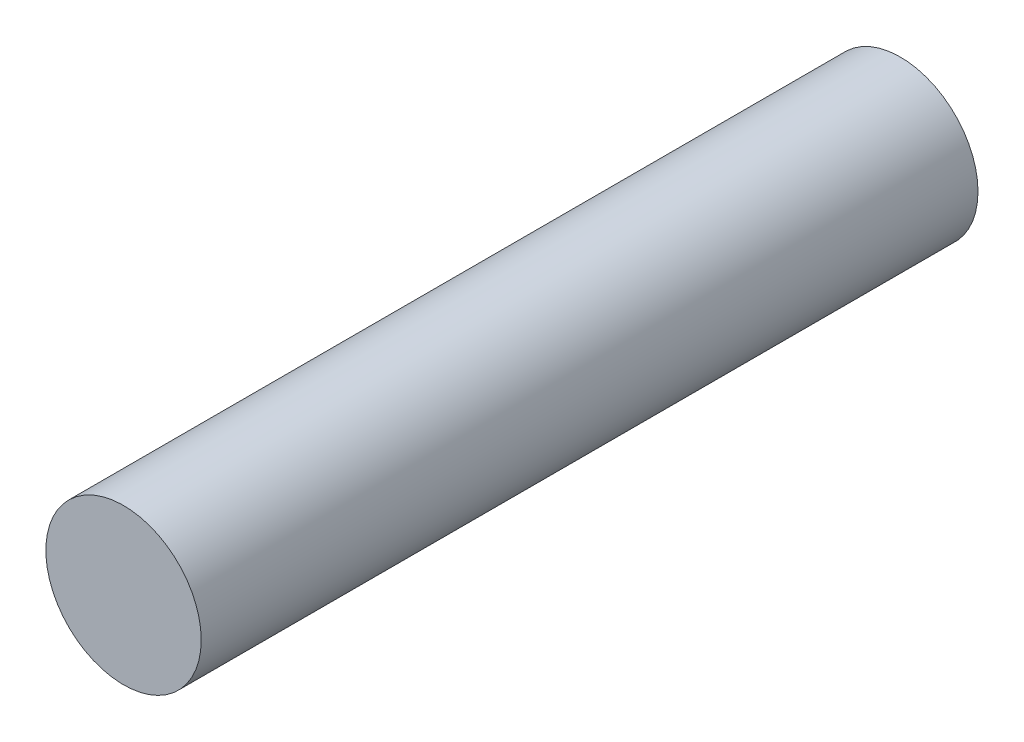
ISO-10303-21;
HEADER;
FILE_DESCRIPTION(('STEP AP214'),'2;1');
FILE_NAME('part.step','',(''),(''),'','','');
FILE_SCHEMA(('AUTOMOTIVE_DESIGN { 1 0 10303 214 1 1 1 1 }'));
ENDSEC;
DATA;
#1=APPLICATION_CONTEXT('core data for automotive mechanical design processes');
#2=APPLICATION_PROTOCOL_DEFINITION('international standard','automotive_design',2000,#1);
#3=PRODUCT_CONTEXT('',#1,'mechanical');
#4=PRODUCT('Part','Part','',(#3));
#5=PRODUCT_RELATED_PRODUCT_CATEGORY('part','',(#4));
#6=PRODUCT_DEFINITION_FORMATION('','',#4);
#7=PRODUCT_DEFINITION_CONTEXT('part definition',#1,'design');
#8=PRODUCT_DEFINITION('design','',#6,#7);
#9=PRODUCT_DEFINITION_SHAPE('','',#8);
#10=(LENGTH_UNIT() NAMED_UNIT(*) SI_UNIT(.MILLI.,.METRE.));
#11=(NAMED_UNIT(*) PLANE_ANGLE_UNIT() SI_UNIT($,.RADIAN.));
#12=(NAMED_UNIT(*) SI_UNIT($,.STERADIAN.) SOLID_ANGLE_UNIT());
#13=UNCERTAINTY_MEASURE_WITH_UNIT(LENGTH_MEASURE(1.E-05),#10,'distance_accuracy_value','');
#14=(GEOMETRIC_REPRESENTATION_CONTEXT(3) GLOBAL_UNCERTAINTY_ASSIGNED_CONTEXT((#13)) GLOBAL_UNIT_ASSIGNED_CONTEXT((#10,
#11,#12)) REPRESENTATION_CONTEXT('',''));
#15=CARTESIAN_POINT('',(0.,0.,0.));
#16=DIRECTION('',(0.,0.,1.));
#17=DIRECTION('',(1.,0.,0.));
#18=AXIS2_PLACEMENT_3D('',#15,#16,#17);
#19=CARTESIAN_POINT('',(0.,0.,31.75));
#20=DIRECTION('',(0.,0.,-1.));
#21=DIRECTION('',(-1.,0.,0.));
#22=AXIS2_PLACEMENT_3D('',#19,#20,#21);
#23=CYLINDRICAL_SURFACE('',#22,3.175);
#24=CARTESIAN_POINT('',(0.,0.,31.75));
#25=DIRECTION('',(0.,0.,1.));
#26=DIRECTION('',(1.,0.,0.));
#27=AXIS2_PLACEMENT_3D('',#24,#25,#26);
#28=CIRCLE('',#27,3.175);
#29=CARTESIAN_POINT('',(3.175,0.,31.75));
#30=VERTEX_POINT('',#29);
#31=EDGE_CURVE('E10',#30,#30,#28,.T.);
#32=ORIENTED_EDGE('',*,*,#31,.F.);
#33=EDGE_LOOP('',(#32));
#34=FACE_BOUND('',#33,.T.);
#35=CARTESIAN_POINT('',(0.,0.,0.));
#36=DIRECTION('',(0.,0.,1.));
#37=DIRECTION('',(1.,0.,0.));
#38=AXIS2_PLACEMENT_3D('',#35,#36,#37);
#39=CIRCLE('',#38,3.175);
#40=CARTESIAN_POINT('',(3.175,0.,0.));
#41=VERTEX_POINT('',#40);
#42=EDGE_CURVE('E44',#41,#41,#39,.T.);
#43=ORIENTED_EDGE('',*,*,#42,.T.);
#44=EDGE_LOOP('',(#43));
#45=FACE_BOUND('',#44,.T.);
#46=ADVANCED_FACE('F41',(#34,#45),#23,.T.);
#47=CARTESIAN_POINT('',(0.,0.,31.75));
#48=DIRECTION('',(0.,0.,1.));
#49=DIRECTION('',(1.,0.,0.));
#50=AXIS2_PLACEMENT_3D('',#47,#48,#49);
#51=PLANE('',#50);
#52=ORIENTED_EDGE('',*,*,#31,.T.);
#53=EDGE_LOOP('',(#52));
#54=FACE_BOUND('',#53,.T.);
#55=ADVANCED_FACE('F56',(#54),#51,.T.);
#56=CARTESIAN_POINT('',(0.,0.,0.));
#57=DIRECTION('',(0.,0.,1.));
#58=DIRECTION('',(1.,0.,0.));
#59=AXIS2_PLACEMENT_3D('',#56,#57,#58);
#60=PLANE('',#59);
#61=ORIENTED_EDGE('',*,*,#42,.F.);
#62=EDGE_LOOP('',(#61));
#63=FACE_BOUND('',#62,.T.);
#64=ADVANCED_FACE('F54',(#63),#60,.F.);
#65=CLOSED_SHELL('',(#46,#55,#64));
#66=MANIFOLD_SOLID_BREP('B2',#65);
#67=ADVANCED_BREP_SHAPE_REPRESENTATION('',(#18,#66),#14);
#68=SHAPE_DEFINITION_REPRESENTATION(#9,#67);
ENDSEC;
END-ISO-10303-21;
